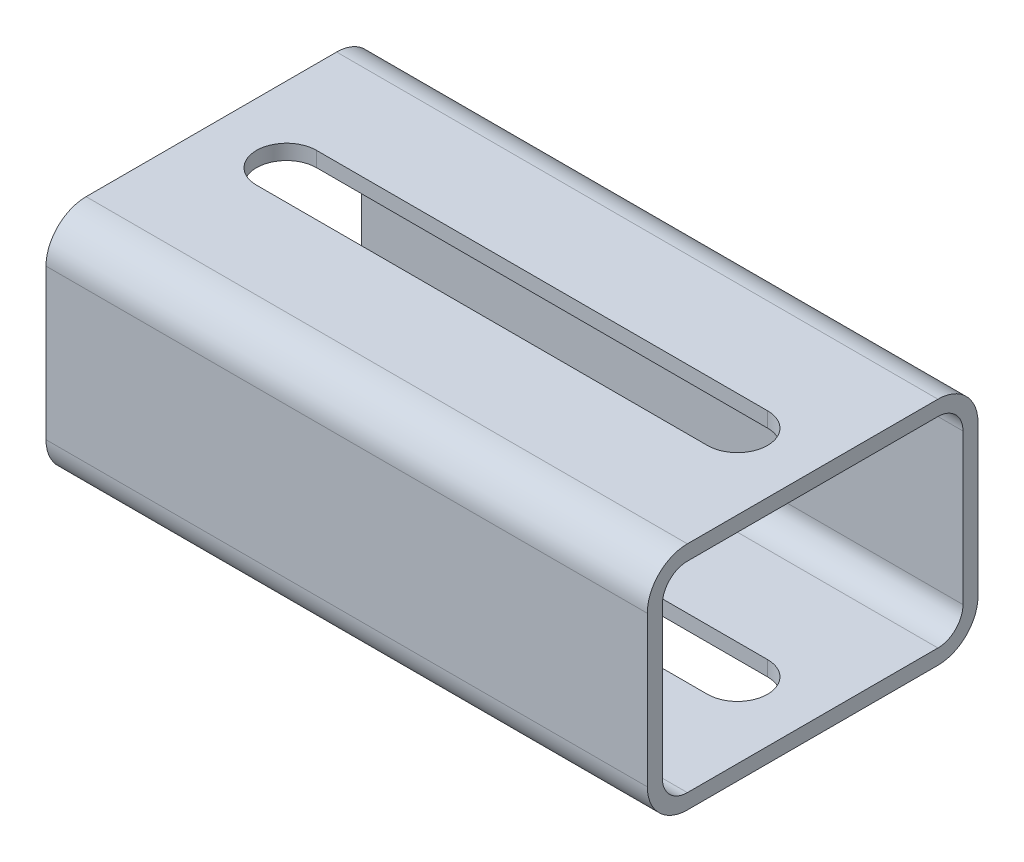
ISO-10303-21;
HEADER;
FILE_DESCRIPTION(('STEP AP214'),'2;1');
FILE_NAME('part.step','',(''),(''),'','','');
FILE_SCHEMA(('AUTOMOTIVE_DESIGN { 1 0 10303 214 1 1 1 1 }'));
ENDSEC;
DATA;
#1=APPLICATION_CONTEXT('core data for automotive mechanical design processes');
#2=APPLICATION_PROTOCOL_DEFINITION('international standard','automotive_design',2000,#1);
#3=PRODUCT_CONTEXT('',#1,'mechanical');
#4=PRODUCT('Part','Part','',(#3));
#5=PRODUCT_RELATED_PRODUCT_CATEGORY('part','',(#4));
#6=PRODUCT_DEFINITION_FORMATION('','',#4);
#7=PRODUCT_DEFINITION_CONTEXT('part definition',#1,'design');
#8=PRODUCT_DEFINITION('design','',#6,#7);
#9=PRODUCT_DEFINITION_SHAPE('','',#8);
#10=(LENGTH_UNIT() NAMED_UNIT(*) SI_UNIT(.MILLI.,.METRE.));
#11=(NAMED_UNIT(*) PLANE_ANGLE_UNIT() SI_UNIT($,.RADIAN.));
#12=(NAMED_UNIT(*) SI_UNIT($,.STERADIAN.) SOLID_ANGLE_UNIT());
#13=UNCERTAINTY_MEASURE_WITH_UNIT(LENGTH_MEASURE(1.E-05),#10,'distance_accuracy_value','');
#14=(GEOMETRIC_REPRESENTATION_CONTEXT(3) GLOBAL_UNCERTAINTY_ASSIGNED_CONTEXT((#13)) GLOBAL_UNIT_ASSIGNED_CONTEXT((#10,
#11,#12)) REPRESENTATION_CONTEXT('',''));
#15=CARTESIAN_POINT('',(0.,0.,0.));
#16=DIRECTION('',(0.,0.,1.));
#17=DIRECTION('',(1.,0.,0.));
#18=AXIS2_PLACEMENT_3D('',#15,#16,#17);
#19=CARTESIAN_POINT('',(60.,15.,-25.));
#20=DIRECTION('',(-1.,0.,0.));
#21=DIRECTION('',(0.,0.,1.));
#22=AXIS2_PLACEMENT_3D('',#19,#20,#21);
#23=PLANE('',#22);
#24=CARTESIAN_POINT('',(60.,15.,-25.));
#25=DIRECTION('',(-1.,0.,0.));
#26=DIRECTION('',(0.,0.,1.));
#27=AXIS2_PLACEMENT_3D('',#24,#25,#26);
#28=CIRCLE('',#27,8.);
#29=CARTESIAN_POINT('',(60.,15.,-33.));
#30=VERTEX_POINT('',#29);
#31=CARTESIAN_POINT('',(60.,23.,-25.));
#32=VERTEX_POINT('',#31);
#33=EDGE_CURVE('E404',#30,#32,#28,.F.);
#34=ORIENTED_EDGE('',*,*,#33,.T.);
#35=DIRECTION('',(0.,0.,1.));
#36=VECTOR('',#35,1.);
#37=CARTESIAN_POINT('',(60.,23.,-25.));
#38=LINE('',#37,#36);
#39=CARTESIAN_POINT('',(60.,23.,25.));
#40=VERTEX_POINT('',#39);
#41=EDGE_CURVE('E408',#32,#40,#38,.T.);
#42=ORIENTED_EDGE('',*,*,#41,.T.);
#43=CARTESIAN_POINT('',(60.,15.,25.));
#44=DIRECTION('',(-1.,0.,0.));
#45=DIRECTION('',(0.,0.,1.));
#46=AXIS2_PLACEMENT_3D('',#43,#44,#45);
#47=CIRCLE('',#46,8.);
#48=CARTESIAN_POINT('',(60.,15.,33.));
#49=VERTEX_POINT('',#48);
#50=EDGE_CURVE('E412',#40,#49,#47,.F.);
#51=ORIENTED_EDGE('',*,*,#50,.T.);
#52=DIRECTION('',(0.,-1.,0.));
#53=VECTOR('',#52,1.);
#54=CARTESIAN_POINT('',(60.,15.,33.));
#55=LINE('',#54,#53);
#56=CARTESIAN_POINT('',(60.,-15.,33.));
#57=VERTEX_POINT('',#56);
#58=EDGE_CURVE('E415',#49,#57,#55,.T.);
#59=ORIENTED_EDGE('',*,*,#58,.T.);
#60=CARTESIAN_POINT('',(60.,-15.,25.));
#61=DIRECTION('',(-1.,0.,0.));
#62=DIRECTION('',(0.,0.,1.));
#63=AXIS2_PLACEMENT_3D('',#60,#61,#62);
#64=CIRCLE('',#63,8.);
#65=CARTESIAN_POINT('',(60.,-23.,25.));
#66=VERTEX_POINT('',#65);
#67=EDGE_CURVE('E418',#57,#66,#64,.F.);
#68=ORIENTED_EDGE('',*,*,#67,.T.);
#69=DIRECTION('',(0.,0.,-1.));
#70=VECTOR('',#69,1.);
#71=CARTESIAN_POINT('',(60.,-23.,-25.));
#72=LINE('',#71,#70);
#73=CARTESIAN_POINT('',(60.,-23.,-25.));
#74=VERTEX_POINT('',#73);
#75=EDGE_CURVE('E421',#66,#74,#72,.T.);
#76=ORIENTED_EDGE('',*,*,#75,.T.);
#77=CARTESIAN_POINT('',(60.,-15.,-25.));
#78=DIRECTION('',(-1.,0.,0.));
#79=DIRECTION('',(0.,0.,1.));
#80=AXIS2_PLACEMENT_3D('',#77,#78,#79);
#81=CIRCLE('',#80,8.);
#82=CARTESIAN_POINT('',(60.,-15.,-33.));
#83=VERTEX_POINT('',#82);
#84=EDGE_CURVE('E424',#74,#83,#81,.F.);
#85=ORIENTED_EDGE('',*,*,#84,.T.);
#86=DIRECTION('',(0.,1.,0.));
#87=VECTOR('',#86,1.);
#88=CARTESIAN_POINT('',(60.,15.,-33.));
#89=LINE('',#88,#87);
#90=EDGE_CURVE('E427',#83,#30,#89,.T.);
#91=ORIENTED_EDGE('',*,*,#90,.T.);
#92=EDGE_LOOP('',(#34,#42,#51,#59,#68,#76,#85,#91));
#93=FACE_BOUND('',#92,.T.);
#94=CARTESIAN_POINT('',(60.,15.,-25.));
#95=DIRECTION('',(1.,0.,0.));
#96=DIRECTION('',(0.,0.,1.));
#97=AXIS2_PLACEMENT_3D('',#94,#95,#96);
#98=CIRCLE('',#97,5.);
#99=CARTESIAN_POINT('',(60.,15.,-30.));
#100=VERTEX_POINT('',#99);
#101=CARTESIAN_POINT('',(60.,20.,-25.));
#102=VERTEX_POINT('',#101);
#103=EDGE_CURVE('E321',#100,#102,#98,.T.);
#104=ORIENTED_EDGE('',*,*,#103,.F.);
#105=DIRECTION('',(0.,1.,0.));
#106=VECTOR('',#105,1.);
#107=CARTESIAN_POINT('',(60.,-15.,-30.));
#108=LINE('',#107,#106);
#109=CARTESIAN_POINT('',(60.,-15.,-30.));
#110=VERTEX_POINT('',#109);
#111=EDGE_CURVE('E344',#110,#100,#108,.T.);
#112=ORIENTED_EDGE('',*,*,#111,.F.);
#113=CARTESIAN_POINT('',(60.,-15.,-25.));
#114=DIRECTION('',(1.,0.,0.));
#115=DIRECTION('',(0.,0.,-1.));
#116=AXIS2_PLACEMENT_3D('',#113,#114,#115);
#117=CIRCLE('',#116,5.);
#118=CARTESIAN_POINT('',(60.,-20.,-25.));
#119=VERTEX_POINT('',#118);
#120=EDGE_CURVE('E340',#119,#110,#117,.T.);
#121=ORIENTED_EDGE('',*,*,#120,.F.);
#122=DIRECTION('',(0.,0.,-1.));
#123=VECTOR('',#122,1.);
#124=CARTESIAN_POINT('',(60.,-20.,25.));
#125=LINE('',#124,#123);
#126=CARTESIAN_POINT('',(60.,-20.,25.));
#127=VERTEX_POINT('',#126);
#128=EDGE_CURVE('E337',#127,#119,#125,.T.);
#129=ORIENTED_EDGE('',*,*,#128,.F.);
#130=CARTESIAN_POINT('',(60.,-15.,25.));
#131=DIRECTION('',(1.,0.,0.));
#132=DIRECTION('',(0.,0.,1.));
#133=AXIS2_PLACEMENT_3D('',#130,#131,#132);
#134=CIRCLE('',#133,5.);
#135=CARTESIAN_POINT('',(60.,-15.,30.));
#136=VERTEX_POINT('',#135);
#137=EDGE_CURVE('E334',#136,#127,#134,.T.);
#138=ORIENTED_EDGE('',*,*,#137,.F.);
#139=DIRECTION('',(0.,-1.,0.));
#140=VECTOR('',#139,1.);
#141=CARTESIAN_POINT('',(60.,-15.,30.));
#142=LINE('',#141,#140);
#143=CARTESIAN_POINT('',(60.,15.,30.));
#144=VERTEX_POINT('',#143);
#145=EDGE_CURVE('E331',#144,#136,#142,.T.);
#146=ORIENTED_EDGE('',*,*,#145,.F.);
#147=CARTESIAN_POINT('',(60.,15.,25.));
#148=DIRECTION('',(1.,0.,0.));
#149=DIRECTION('',(0.,0.,-1.));
#150=AXIS2_PLACEMENT_3D('',#147,#148,#149);
#151=CIRCLE('',#150,5.);
#152=CARTESIAN_POINT('',(60.,20.,25.));
#153=VERTEX_POINT('',#152);
#154=EDGE_CURVE('E328',#153,#144,#151,.T.);
#155=ORIENTED_EDGE('',*,*,#154,.F.);
#156=DIRECTION('',(0.,0.,1.));
#157=VECTOR('',#156,1.);
#158=CARTESIAN_POINT('',(60.,20.,25.));
#159=LINE('',#158,#157);
#160=EDGE_CURVE('E324',#102,#153,#159,.T.);
#161=ORIENTED_EDGE('',*,*,#160,.F.);
#162=EDGE_LOOP('',(#104,#112,#121,#129,#138,#146,#155,#161));
#163=FACE_BOUND('',#162,.T.);
#164=ADVANCED_FACE('F87',(#93,#163),#23,.F.);
#165=CARTESIAN_POINT('',(-60.,15.,-25.));
#166=DIRECTION('',(-1.,0.,0.));
#167=DIRECTION('',(0.,0.,1.));
#168=AXIS2_PLACEMENT_3D('',#165,#166,#167);
#169=PLANE('',#168);
#170=CARTESIAN_POINT('',(-60.,15.,-25.));
#171=DIRECTION('',(-1.,0.,0.));
#172=DIRECTION('',(0.,0.,1.));
#173=AXIS2_PLACEMENT_3D('',#170,#171,#172);
#174=CIRCLE('',#173,8.);
#175=CARTESIAN_POINT('',(-60.,15.,-33.));
#176=VERTEX_POINT('',#175);
#177=CARTESIAN_POINT('',(-60.,23.,-25.));
#178=VERTEX_POINT('',#177);
#179=EDGE_CURVE('E403',#176,#178,#174,.F.);
#180=ORIENTED_EDGE('',*,*,#179,.F.);
#181=DIRECTION('',(0.,1.,0.));
#182=VECTOR('',#181,1.);
#183=CARTESIAN_POINT('',(-60.,15.,-33.));
#184=LINE('',#183,#182);
#185=CARTESIAN_POINT('',(-60.,-15.,-33.));
#186=VERTEX_POINT('',#185);
#187=EDGE_CURVE('E409',#186,#176,#184,.T.);
#188=ORIENTED_EDGE('',*,*,#187,.F.);
#189=CARTESIAN_POINT('',(-60.,-15.,-25.));
#190=DIRECTION('',(-1.,0.,0.));
#191=DIRECTION('',(0.,0.,1.));
#192=AXIS2_PLACEMENT_3D('',#189,#190,#191);
#193=CIRCLE('',#192,8.);
#194=CARTESIAN_POINT('',(-60.,-23.,-25.));
#195=VERTEX_POINT('',#194);
#196=EDGE_CURVE('E449',#195,#186,#193,.F.);
#197=ORIENTED_EDGE('',*,*,#196,.F.);
#198=DIRECTION('',(0.,0.,-1.));
#199=VECTOR('',#198,1.);
#200=CARTESIAN_POINT('',(-60.,-23.,-25.));
#201=LINE('',#200,#199);
#202=CARTESIAN_POINT('',(-60.,-23.,25.));
#203=VERTEX_POINT('',#202);
#204=EDGE_CURVE('E446',#203,#195,#201,.T.);
#205=ORIENTED_EDGE('',*,*,#204,.F.);
#206=CARTESIAN_POINT('',(-60.,-15.,25.));
#207=DIRECTION('',(-1.,0.,0.));
#208=DIRECTION('',(0.,0.,1.));
#209=AXIS2_PLACEMENT_3D('',#206,#207,#208);
#210=CIRCLE('',#209,8.);
#211=CARTESIAN_POINT('',(-60.,-15.,33.));
#212=VERTEX_POINT('',#211);
#213=EDGE_CURVE('E443',#212,#203,#210,.F.);
#214=ORIENTED_EDGE('',*,*,#213,.F.);
#215=DIRECTION('',(0.,-1.,0.));
#216=VECTOR('',#215,1.);
#217=CARTESIAN_POINT('',(-60.,15.,33.));
#218=LINE('',#217,#216);
#219=CARTESIAN_POINT('',(-60.,15.,33.));
#220=VERTEX_POINT('',#219);
#221=EDGE_CURVE('E440',#220,#212,#218,.T.);
#222=ORIENTED_EDGE('',*,*,#221,.F.);
#223=CARTESIAN_POINT('',(-60.,15.,25.));
#224=DIRECTION('',(-1.,0.,0.));
#225=DIRECTION('',(0.,0.,1.));
#226=AXIS2_PLACEMENT_3D('',#223,#224,#225);
#227=CIRCLE('',#226,8.);
#228=CARTESIAN_POINT('',(-60.,23.,25.));
#229=VERTEX_POINT('',#228);
#230=EDGE_CURVE('E437',#229,#220,#227,.F.);
#231=ORIENTED_EDGE('',*,*,#230,.F.);
#232=DIRECTION('',(0.,0.,1.));
#233=VECTOR('',#232,1.);
#234=CARTESIAN_POINT('',(-60.,23.,-25.));
#235=LINE('',#234,#233);
#236=EDGE_CURVE('E434',#178,#229,#235,.T.);
#237=ORIENTED_EDGE('',*,*,#236,.F.);
#238=EDGE_LOOP('',(#180,#188,#197,#205,#214,#222,#231,#237));
#239=FACE_BOUND('',#238,.T.);
#240=DIRECTION('',(0.,1.,0.));
#241=VECTOR('',#240,1.);
#242=CARTESIAN_POINT('',(-60.,-15.,-30.));
#243=LINE('',#242,#241);
#244=CARTESIAN_POINT('',(-60.,-15.,-30.));
#245=VERTEX_POINT('',#244);
#246=CARTESIAN_POINT('',(-60.,15.,-30.));
#247=VERTEX_POINT('',#246);
#248=EDGE_CURVE('E325',#245,#247,#243,.T.);
#249=ORIENTED_EDGE('',*,*,#248,.T.);
#250=CARTESIAN_POINT('',(-60.,15.,-25.));
#251=DIRECTION('',(1.,0.,0.));
#252=DIRECTION('',(0.,0.,1.));
#253=AXIS2_PLACEMENT_3D('',#250,#251,#252);
#254=CIRCLE('',#253,5.);
#255=CARTESIAN_POINT('',(-60.,20.,-25.));
#256=VERTEX_POINT('',#255);
#257=EDGE_CURVE('E320',#247,#256,#254,.T.);
#258=ORIENTED_EDGE('',*,*,#257,.T.);
#259=DIRECTION('',(0.,0.,1.));
#260=VECTOR('',#259,1.);
#261=CARTESIAN_POINT('',(-60.,20.,25.));
#262=LINE('',#261,#260);
#263=CARTESIAN_POINT('',(-60.,20.,25.));
#264=VERTEX_POINT('',#263);
#265=EDGE_CURVE('E351',#256,#264,#262,.T.);
#266=ORIENTED_EDGE('',*,*,#265,.T.);
#267=CARTESIAN_POINT('',(-60.,15.,25.));
#268=DIRECTION('',(1.,0.,0.));
#269=DIRECTION('',(0.,0.,-1.));
#270=AXIS2_PLACEMENT_3D('',#267,#268,#269);
#271=CIRCLE('',#270,5.);
#272=CARTESIAN_POINT('',(-60.,15.,30.));
#273=VERTEX_POINT('',#272);
#274=EDGE_CURVE('E355',#264,#273,#271,.T.);
#275=ORIENTED_EDGE('',*,*,#274,.T.);
#276=DIRECTION('',(0.,-1.,0.));
#277=VECTOR('',#276,1.);
#278=CARTESIAN_POINT('',(-60.,-15.,30.));
#279=LINE('',#278,#277);
#280=CARTESIAN_POINT('',(-60.,-15.,30.));
#281=VERTEX_POINT('',#280);
#282=EDGE_CURVE('E359',#273,#281,#279,.T.);
#283=ORIENTED_EDGE('',*,*,#282,.T.);
#284=CARTESIAN_POINT('',(-60.,-15.,25.));
#285=DIRECTION('',(1.,0.,0.));
#286=DIRECTION('',(0.,0.,1.));
#287=AXIS2_PLACEMENT_3D('',#284,#285,#286);
#288=CIRCLE('',#287,5.);
#289=CARTESIAN_POINT('',(-60.,-20.,25.));
#290=VERTEX_POINT('',#289);
#291=EDGE_CURVE('E363',#281,#290,#288,.T.);
#292=ORIENTED_EDGE('',*,*,#291,.T.);
#293=DIRECTION('',(0.,0.,-1.));
#294=VECTOR('',#293,1.);
#295=CARTESIAN_POINT('',(-60.,-20.,25.));
#296=LINE('',#295,#294);
#297=CARTESIAN_POINT('',(-60.,-20.,-25.));
#298=VERTEX_POINT('',#297);
#299=EDGE_CURVE('E367',#290,#298,#296,.T.);
#300=ORIENTED_EDGE('',*,*,#299,.T.);
#301=CARTESIAN_POINT('',(-60.,-15.,-25.));
#302=DIRECTION('',(1.,0.,0.));
#303=DIRECTION('',(0.,0.,-1.));
#304=AXIS2_PLACEMENT_3D('',#301,#302,#303);
#305=CIRCLE('',#304,5.);
#306=EDGE_CURVE('E371',#298,#245,#305,.T.);
#307=ORIENTED_EDGE('',*,*,#306,.T.);
#308=EDGE_LOOP('',(#249,#258,#266,#275,#283,#292,#300,#307));
#309=FACE_BOUND('',#308,.T.);
#310=ADVANCED_FACE('F514',(#239,#309),#169,.T.);
#311=CARTESIAN_POINT('',(60.,15.,-25.));
#312=DIRECTION('',(-1.,0.,0.));
#313=DIRECTION('',(0.,0.,1.));
#314=AXIS2_PLACEMENT_3D('',#311,#312,#313);
#315=CYLINDRICAL_SURFACE('',#314,8.);
#316=ORIENTED_EDGE('',*,*,#179,.T.);
#317=DIRECTION('',(-1.,0.,0.));
#318=VECTOR('',#317,1.);
#319=CARTESIAN_POINT('',(60.,23.,-25.));
#320=LINE('',#319,#318);
#321=EDGE_CURVE('E481',#32,#178,#320,.T.);
#322=ORIENTED_EDGE('',*,*,#321,.F.);
#323=ORIENTED_EDGE('',*,*,#33,.F.);
#324=DIRECTION('',(-1.,0.,0.));
#325=VECTOR('',#324,1.);
#326=CARTESIAN_POINT('',(60.,15.,-33.));
#327=LINE('',#326,#325);
#328=EDGE_CURVE('E430',#30,#176,#327,.T.);
#329=ORIENTED_EDGE('',*,*,#328,.T.);
#330=EDGE_LOOP('',(#316,#322,#323,#329));
#331=FACE_BOUND('',#330,.T.);
#332=ADVANCED_FACE('F89',(#331),#315,.T.);
#333=CARTESIAN_POINT('',(60.,23.,-25.));
#334=DIRECTION('',(0.,-1.,0.));
#335=DIRECTION('',(0.,0.,-1.));
#336=AXIS2_PLACEMENT_3D('',#333,#334,#335);
#337=PLANE('',#336);
#338=DIRECTION('',(1.,0.,0.));
#339=VECTOR('',#338,1.);
#340=CARTESIAN_POINT('',(-45.,23.,6.00000000000001));
#341=LINE('',#340,#339);
#342=CARTESIAN_POINT('',(-45.,23.,6.00000000000001));
#343=VERTEX_POINT('',#342);
#344=CARTESIAN_POINT('',(45.,23.,5.99999999999999));
#345=VERTEX_POINT('',#344);
#346=EDGE_CURVE('E289',#343,#345,#341,.T.);
#347=ORIENTED_EDGE('',*,*,#346,.F.);
#348=CARTESIAN_POINT('',(-45.,23.,0.));
#349=DIRECTION('',(0.,1.,0.));
#350=DIRECTION('',(0.,0.,1.));
#351=AXIS2_PLACEMENT_3D('',#348,#349,#350);
#352=CIRCLE('',#351,6.00000000000001);
#353=CARTESIAN_POINT('',(-45.,23.,-6.00000000000001));
#354=VERTEX_POINT('',#353);
#355=EDGE_CURVE('E103',#354,#343,#352,.T.);
#356=ORIENTED_EDGE('',*,*,#355,.F.);
#357=DIRECTION('',(-1.,0.,0.));
#358=VECTOR('',#357,1.);
#359=CARTESIAN_POINT('',(-45.,23.,-6.00000000000001));
#360=LINE('',#359,#358);
#361=CARTESIAN_POINT('',(45.,23.,-6.00000000000001));
#362=VERTEX_POINT('',#361);
#363=EDGE_CURVE('E276',#362,#354,#360,.T.);
#364=ORIENTED_EDGE('',*,*,#363,.F.);
#365=CARTESIAN_POINT('',(45.,23.,0.));
#366=DIRECTION('',(0.,1.,0.));
#367=DIRECTION('',(0.,0.,1.));
#368=AXIS2_PLACEMENT_3D('',#365,#366,#367);
#369=CIRCLE('',#368,6.00000000000001);
#370=EDGE_CURVE('E280',#345,#362,#369,.T.);
#371=ORIENTED_EDGE('',*,*,#370,.F.);
#372=EDGE_LOOP('',(#347,#356,#364,#371));
#373=FACE_BOUND('',#372,.T.);
#374=ORIENTED_EDGE('',*,*,#236,.T.);
#375=DIRECTION('',(-1.,0.,0.));
#376=VECTOR('',#375,1.);
#377=CARTESIAN_POINT('',(60.,23.,25.));
#378=LINE('',#377,#376);
#379=EDGE_CURVE('E477',#40,#229,#378,.T.);
#380=ORIENTED_EDGE('',*,*,#379,.F.);
#381=ORIENTED_EDGE('',*,*,#41,.F.);
#382=ORIENTED_EDGE('',*,*,#321,.T.);
#383=EDGE_LOOP('',(#374,#380,#381,#382));
#384=FACE_BOUND('',#383,.T.);
#385=ADVANCED_FACE('F547',(#373,#384),#337,.F.);
#386=CARTESIAN_POINT('',(60.,15.,25.));
#387=DIRECTION('',(-1.,0.,0.));
#388=DIRECTION('',(0.,0.,1.));
#389=AXIS2_PLACEMENT_3D('',#386,#387,#388);
#390=CYLINDRICAL_SURFACE('',#389,8.);
#391=ORIENTED_EDGE('',*,*,#230,.T.);
#392=DIRECTION('',(-1.,0.,0.));
#393=VECTOR('',#392,1.);
#394=CARTESIAN_POINT('',(60.,15.,33.));
#395=LINE('',#394,#393);
#396=EDGE_CURVE('E473',#49,#220,#395,.T.);
#397=ORIENTED_EDGE('',*,*,#396,.F.);
#398=ORIENTED_EDGE('',*,*,#50,.F.);
#399=ORIENTED_EDGE('',*,*,#379,.T.);
#400=EDGE_LOOP('',(#391,#397,#398,#399));
#401=FACE_BOUND('',#400,.T.);
#402=ADVANCED_FACE('F544',(#401),#390,.T.);
#403=CARTESIAN_POINT('',(60.,15.,33.));
#404=DIRECTION('',(0.,0.,-1.));
#405=DIRECTION('',(-1.,0.,0.));
#406=AXIS2_PLACEMENT_3D('',#403,#404,#405);
#407=PLANE('',#406);
#408=ORIENTED_EDGE('',*,*,#221,.T.);
#409=DIRECTION('',(-1.,0.,0.));
#410=VECTOR('',#409,1.);
#411=CARTESIAN_POINT('',(60.,-15.,33.));
#412=LINE('',#411,#410);
#413=EDGE_CURVE('E469',#57,#212,#412,.T.);
#414=ORIENTED_EDGE('',*,*,#413,.F.);
#415=ORIENTED_EDGE('',*,*,#58,.F.);
#416=ORIENTED_EDGE('',*,*,#396,.T.);
#417=EDGE_LOOP('',(#408,#414,#415,#416));
#418=FACE_BOUND('',#417,.T.);
#419=ADVANCED_FACE('F540',(#418),#407,.F.);
#420=CARTESIAN_POINT('',(60.,-15.,25.));
#421=DIRECTION('',(-1.,0.,0.));
#422=DIRECTION('',(0.,0.,1.));
#423=AXIS2_PLACEMENT_3D('',#420,#421,#422);
#424=CYLINDRICAL_SURFACE('',#423,8.);
#425=ORIENTED_EDGE('',*,*,#213,.T.);
#426=DIRECTION('',(-1.,0.,0.));
#427=VECTOR('',#426,1.);
#428=CARTESIAN_POINT('',(60.,-23.,25.));
#429=LINE('',#428,#427);
#430=EDGE_CURVE('E465',#66,#203,#429,.T.);
#431=ORIENTED_EDGE('',*,*,#430,.F.);
#432=ORIENTED_EDGE('',*,*,#67,.F.);
#433=ORIENTED_EDGE('',*,*,#413,.T.);
#434=EDGE_LOOP('',(#425,#431,#432,#433));
#435=FACE_BOUND('',#434,.T.);
#436=ADVANCED_FACE('F537',(#435),#424,.T.);
#437=CARTESIAN_POINT('',(60.,-23.,-25.));
#438=DIRECTION('',(0.,1.,0.));
#439=DIRECTION('',(0.,0.,1.));
#440=AXIS2_PLACEMENT_3D('',#437,#438,#439);
#441=PLANE('',#440);
#442=DIRECTION('',(-1.,0.,0.));
#443=VECTOR('',#442,1.);
#444=CARTESIAN_POINT('',(-45.,-23.,-6.00000000000001));
#445=LINE('',#444,#443);
#446=CARTESIAN_POINT('',(45.,-23.,-6.00000000000001));
#447=VERTEX_POINT('',#446);
#448=CARTESIAN_POINT('',(-45.,-23.,-6.00000000000001));
#449=VERTEX_POINT('',#448);
#450=EDGE_CURVE('E274',#447,#449,#445,.T.);
#451=ORIENTED_EDGE('',*,*,#450,.T.);
#452=CARTESIAN_POINT('',(-45.,-23.,0.));
#453=DIRECTION('',(0.,1.,0.));
#454=DIRECTION('',(0.,0.,1.));
#455=AXIS2_PLACEMENT_3D('',#452,#453,#454);
#456=CIRCLE('',#455,6.00000000000001);
#457=CARTESIAN_POINT('',(-45.,-23.,6.00000000000001));
#458=VERTEX_POINT('',#457);
#459=EDGE_CURVE('E255',#449,#458,#456,.T.);
#460=ORIENTED_EDGE('',*,*,#459,.T.);
#461=DIRECTION('',(1.,0.,0.));
#462=VECTOR('',#461,1.);
#463=CARTESIAN_POINT('',(-45.,-23.,6.00000000000001));
#464=LINE('',#463,#462);
#465=CARTESIAN_POINT('',(45.,-23.,6.00000000000001));
#466=VERTEX_POINT('',#465);
#467=EDGE_CURVE('E265',#458,#466,#464,.T.);
#468=ORIENTED_EDGE('',*,*,#467,.T.);
#469=CARTESIAN_POINT('',(45.,-23.,0.));
#470=DIRECTION('',(0.,1.,0.));
#471=DIRECTION('',(0.,0.,1.));
#472=AXIS2_PLACEMENT_3D('',#469,#470,#471);
#473=CIRCLE('',#472,6.00000000000001);
#474=EDGE_CURVE('E111',#466,#447,#473,.T.);
#475=ORIENTED_EDGE('',*,*,#474,.T.);
#476=EDGE_LOOP('',(#451,#460,#468,#475));
#477=FACE_BOUND('',#476,.T.);
#478=ORIENTED_EDGE('',*,*,#204,.T.);
#479=DIRECTION('',(-1.,0.,0.));
#480=VECTOR('',#479,1.);
#481=CARTESIAN_POINT('',(60.,-23.,-25.));
#482=LINE('',#481,#480);
#483=EDGE_CURVE('E461',#74,#195,#482,.T.);
#484=ORIENTED_EDGE('',*,*,#483,.F.);
#485=ORIENTED_EDGE('',*,*,#75,.F.);
#486=ORIENTED_EDGE('',*,*,#430,.T.);
#487=EDGE_LOOP('',(#478,#484,#485,#486));
#488=FACE_BOUND('',#487,.T.);
#489=ADVANCED_FACE('F271',(#477,#488),#441,.F.);
#490=CARTESIAN_POINT('',(60.,-15.,-25.));
#491=DIRECTION('',(-1.,0.,0.));
#492=DIRECTION('',(0.,0.,1.));
#493=AXIS2_PLACEMENT_3D('',#490,#491,#492);
#494=CYLINDRICAL_SURFACE('',#493,8.);
#495=ORIENTED_EDGE('',*,*,#196,.T.);
#496=DIRECTION('',(-1.,0.,0.));
#497=VECTOR('',#496,1.);
#498=CARTESIAN_POINT('',(60.,-15.,-33.));
#499=LINE('',#498,#497);
#500=EDGE_CURVE('E457',#83,#186,#499,.T.);
#501=ORIENTED_EDGE('',*,*,#500,.F.);
#502=ORIENTED_EDGE('',*,*,#84,.F.);
#503=ORIENTED_EDGE('',*,*,#483,.T.);
#504=EDGE_LOOP('',(#495,#501,#502,#503));
#505=FACE_BOUND('',#504,.T.);
#506=ADVANCED_FACE('F530',(#505),#494,.T.);
#507=CARTESIAN_POINT('',(60.,15.,-33.));
#508=DIRECTION('',(0.,0.,1.));
#509=DIRECTION('',(1.,0.,0.));
#510=AXIS2_PLACEMENT_3D('',#507,#508,#509);
#511=PLANE('',#510);
#512=ORIENTED_EDGE('',*,*,#187,.T.);
#513=ORIENTED_EDGE('',*,*,#328,.F.);
#514=ORIENTED_EDGE('',*,*,#90,.F.);
#515=ORIENTED_EDGE('',*,*,#500,.T.);
#516=EDGE_LOOP('',(#512,#513,#514,#515));
#517=FACE_BOUND('',#516,.T.);
#518=ADVANCED_FACE('F527',(#517),#511,.F.);
#519=CARTESIAN_POINT('',(60.,15.,-25.));
#520=DIRECTION('',(-1.,0.,0.));
#521=DIRECTION('',(0.,0.,1.));
#522=AXIS2_PLACEMENT_3D('',#519,#520,#521);
#523=CYLINDRICAL_SURFACE('',#522,5.);
#524=ORIENTED_EDGE('',*,*,#257,.F.);
#525=DIRECTION('',(-1.,0.,0.));
#526=VECTOR('',#525,1.);
#527=CARTESIAN_POINT('',(60.,15.,-30.));
#528=LINE('',#527,#526);
#529=EDGE_CURVE('E347',#100,#247,#528,.T.);
#530=ORIENTED_EDGE('',*,*,#529,.F.);
#531=ORIENTED_EDGE('',*,*,#103,.T.);
#532=DIRECTION('',(-1.,0.,0.));
#533=VECTOR('',#532,1.);
#534=CARTESIAN_POINT('',(60.,20.,-25.));
#535=LINE('',#534,#533);
#536=EDGE_CURVE('E399',#102,#256,#535,.T.);
#537=ORIENTED_EDGE('',*,*,#536,.T.);
#538=EDGE_LOOP('',(#524,#530,#531,#537));
#539=FACE_BOUND('',#538,.T.);
#540=ADVANCED_FACE('F524',(#539),#523,.F.);
#541=CARTESIAN_POINT('',(60.,20.,25.));
#542=DIRECTION('',(0.,-1.,0.));
#543=DIRECTION('',(0.,0.,-1.));
#544=AXIS2_PLACEMENT_3D('',#541,#542,#543);
#545=PLANE('',#544);
#546=CARTESIAN_POINT('',(-45.,20.,0.));
#547=DIRECTION('',(0.,-1.,0.));
#548=DIRECTION('',(0.,0.,-1.));
#549=AXIS2_PLACEMENT_3D('',#546,#547,#548);
#550=CIRCLE('',#549,6.00000000000001);
#551=CARTESIAN_POINT('',(-45.,20.,6.00000000000001));
#552=VERTEX_POINT('',#551);
#553=CARTESIAN_POINT('',(-45.,20.,-6.00000000000001));
#554=VERTEX_POINT('',#553);
#555=EDGE_CURVE('E317',#552,#554,#550,.T.);
#556=ORIENTED_EDGE('',*,*,#555,.F.);
#557=DIRECTION('',(-1.,0.,0.));
#558=VECTOR('',#557,1.);
#559=CARTESIAN_POINT('',(60.,20.,6.00000000000001));
#560=LINE('',#559,#558);
#561=CARTESIAN_POINT('',(45.,20.,6.00000000000001));
#562=VERTEX_POINT('',#561);
#563=EDGE_CURVE('E299',#562,#552,#560,.T.);
#564=ORIENTED_EDGE('',*,*,#563,.F.);
#565=CARTESIAN_POINT('',(45.,20.,0.));
#566=DIRECTION('',(0.,-1.,0.));
#567=DIRECTION('',(0.,0.,-1.));
#568=AXIS2_PLACEMENT_3D('',#565,#566,#567);
#569=CIRCLE('',#568,6.00000000000001);
#570=CARTESIAN_POINT('',(45.,20.,-6.00000000000001));
#571=VERTEX_POINT('',#570);
#572=EDGE_CURVE('E310',#571,#562,#569,.T.);
#573=ORIENTED_EDGE('',*,*,#572,.F.);
#574=DIRECTION('',(1.,0.,0.));
#575=VECTOR('',#574,1.);
#576=CARTESIAN_POINT('',(60.,20.,-6.00000000000001));
#577=LINE('',#576,#575);
#578=EDGE_CURVE('E314',#554,#571,#577,.T.);
#579=ORIENTED_EDGE('',*,*,#578,.F.);
#580=EDGE_LOOP('',(#556,#564,#573,#579));
#581=FACE_BOUND('',#580,.T.);
#582=ORIENTED_EDGE('',*,*,#265,.F.);
#583=ORIENTED_EDGE('',*,*,#536,.F.);
#584=ORIENTED_EDGE('',*,*,#160,.T.);
#585=DIRECTION('',(-1.,0.,0.));
#586=VECTOR('',#585,1.);
#587=CARTESIAN_POINT('',(60.,20.,25.));
#588=LINE('',#587,#586);
#589=EDGE_CURVE('E396',#153,#264,#588,.T.);
#590=ORIENTED_EDGE('',*,*,#589,.T.);
#591=EDGE_LOOP('',(#582,#583,#584,#590));
#592=FACE_BOUND('',#591,.T.);
#593=ADVANCED_FACE('F595',(#581,#592),#545,.T.);
#594=CARTESIAN_POINT('',(60.,15.,25.));
#595=DIRECTION('',(-1.,0.,0.));
#596=DIRECTION('',(0.,0.,1.));
#597=AXIS2_PLACEMENT_3D('',#594,#595,#596);
#598=CYLINDRICAL_SURFACE('',#597,5.);
#599=ORIENTED_EDGE('',*,*,#274,.F.);
#600=ORIENTED_EDGE('',*,*,#589,.F.);
#601=ORIENTED_EDGE('',*,*,#154,.T.);
#602=DIRECTION('',(-1.,0.,0.));
#603=VECTOR('',#602,1.);
#604=CARTESIAN_POINT('',(60.,15.,30.));
#605=LINE('',#604,#603);
#606=EDGE_CURVE('E393',#144,#273,#605,.T.);
#607=ORIENTED_EDGE('',*,*,#606,.T.);
#608=EDGE_LOOP('',(#599,#600,#601,#607));
#609=FACE_BOUND('',#608,.T.);
#610=ADVANCED_FACE('F598',(#609),#598,.F.);
#611=CARTESIAN_POINT('',(60.,-15.,30.));
#612=DIRECTION('',(0.,0.,-1.));
#613=DIRECTION('',(-1.,0.,0.));
#614=AXIS2_PLACEMENT_3D('',#611,#612,#613);
#615=PLANE('',#614);
#616=ORIENTED_EDGE('',*,*,#282,.F.);
#617=ORIENTED_EDGE('',*,*,#606,.F.);
#618=ORIENTED_EDGE('',*,*,#145,.T.);
#619=DIRECTION('',(-1.,0.,0.));
#620=VECTOR('',#619,1.);
#621=CARTESIAN_POINT('',(60.,-15.,30.));
#622=LINE('',#621,#620);
#623=EDGE_CURVE('E390',#136,#281,#622,.T.);
#624=ORIENTED_EDGE('',*,*,#623,.T.);
#625=EDGE_LOOP('',(#616,#617,#618,#624));
#626=FACE_BOUND('',#625,.T.);
#627=ADVANCED_FACE('F603',(#626),#615,.T.);
#628=CARTESIAN_POINT('',(60.,-15.,25.));
#629=DIRECTION('',(-1.,0.,0.));
#630=DIRECTION('',(0.,0.,1.));
#631=AXIS2_PLACEMENT_3D('',#628,#629,#630);
#632=CYLINDRICAL_SURFACE('',#631,5.);
#633=ORIENTED_EDGE('',*,*,#291,.F.);
#634=ORIENTED_EDGE('',*,*,#623,.F.);
#635=ORIENTED_EDGE('',*,*,#137,.T.);
#636=DIRECTION('',(-1.,0.,0.));
#637=VECTOR('',#636,1.);
#638=CARTESIAN_POINT('',(60.,-20.,25.));
#639=LINE('',#638,#637);
#640=EDGE_CURVE('E387',#127,#290,#639,.T.);
#641=ORIENTED_EDGE('',*,*,#640,.T.);
#642=EDGE_LOOP('',(#633,#634,#635,#641));
#643=FACE_BOUND('',#642,.T.);
#644=ADVANCED_FACE('F607',(#643),#632,.F.);
#645=CARTESIAN_POINT('',(60.,-20.,25.));
#646=DIRECTION('',(0.,1.,0.));
#647=DIRECTION('',(0.,0.,1.));
#648=AXIS2_PLACEMENT_3D('',#645,#646,#647);
#649=PLANE('',#648);
#650=CARTESIAN_POINT('',(-45.,-20.,0.));
#651=DIRECTION('',(0.,1.,0.));
#652=DIRECTION('',(0.,0.,1.));
#653=AXIS2_PLACEMENT_3D('',#650,#651,#652);
#654=CIRCLE('',#653,6.00000000000001);
#655=CARTESIAN_POINT('',(-45.,-20.,-6.00000000000001));
#656=VERTEX_POINT('',#655);
#657=CARTESIAN_POINT('',(-45.,-20.,6.00000000000001));
#658=VERTEX_POINT('',#657);
#659=EDGE_CURVE('E12',#656,#658,#654,.T.);
#660=ORIENTED_EDGE('',*,*,#659,.F.);
#661=DIRECTION('',(-1.,0.,0.));
#662=VECTOR('',#661,1.);
#663=CARTESIAN_POINT('',(60.,-20.,-6.00000000000001));
#664=LINE('',#663,#662);
#665=CARTESIAN_POINT('',(45.,-20.,-6.00000000000001));
#666=VERTEX_POINT('',#665);
#667=EDGE_CURVE('E96',#666,#656,#664,.T.);
#668=ORIENTED_EDGE('',*,*,#667,.F.);
#669=CARTESIAN_POINT('',(45.,-20.,0.));
#670=DIRECTION('',(0.,1.,0.));
#671=DIRECTION('',(0.,0.,1.));
#672=AXIS2_PLACEMENT_3D('',#669,#670,#671);
#673=CIRCLE('',#672,6.00000000000001);
#674=CARTESIAN_POINT('',(45.,-20.,5.99999999999999));
#675=VERTEX_POINT('',#674);
#676=EDGE_CURVE('E488',#675,#666,#673,.T.);
#677=ORIENTED_EDGE('',*,*,#676,.F.);
#678=DIRECTION('',(1.,0.,0.));
#679=VECTOR('',#678,1.);
#680=CARTESIAN_POINT('',(60.,-20.,6.00000000000001));
#681=LINE('',#680,#679);
#682=EDGE_CURVE('E485',#658,#675,#681,.T.);
#683=ORIENTED_EDGE('',*,*,#682,.F.);
#684=EDGE_LOOP('',(#660,#668,#677,#683));
#685=FACE_BOUND('',#684,.T.);
#686=ORIENTED_EDGE('',*,*,#299,.F.);
#687=ORIENTED_EDGE('',*,*,#640,.F.);
#688=ORIENTED_EDGE('',*,*,#128,.T.);
#689=DIRECTION('',(-1.,0.,0.));
#690=VECTOR('',#689,1.);
#691=CARTESIAN_POINT('',(60.,-20.,-25.));
#692=LINE('',#691,#690);
#693=EDGE_CURVE('E384',#119,#298,#692,.T.);
#694=ORIENTED_EDGE('',*,*,#693,.T.);
#695=EDGE_LOOP('',(#686,#687,#688,#694));
#696=FACE_BOUND('',#695,.T.);
#697=ADVANCED_FACE('F496',(#685,#696),#649,.T.);
#698=CARTESIAN_POINT('',(60.,-15.,-25.));
#699=DIRECTION('',(-1.,0.,0.));
#700=DIRECTION('',(0.,0.,1.));
#701=AXIS2_PLACEMENT_3D('',#698,#699,#700);
#702=CYLINDRICAL_SURFACE('',#701,5.);
#703=ORIENTED_EDGE('',*,*,#306,.F.);
#704=ORIENTED_EDGE('',*,*,#693,.F.);
#705=ORIENTED_EDGE('',*,*,#120,.T.);
#706=DIRECTION('',(-1.,0.,0.));
#707=VECTOR('',#706,1.);
#708=CARTESIAN_POINT('',(60.,-15.,-30.));
#709=LINE('',#708,#707);
#710=EDGE_CURVE('E381',#110,#245,#709,.T.);
#711=ORIENTED_EDGE('',*,*,#710,.T.);
#712=EDGE_LOOP('',(#703,#704,#705,#711));
#713=FACE_BOUND('',#712,.T.);
#714=ADVANCED_FACE('F613',(#713),#702,.F.);
#715=CARTESIAN_POINT('',(60.,-15.,-30.));
#716=DIRECTION('',(0.,0.,1.));
#717=DIRECTION('',(1.,0.,0.));
#718=AXIS2_PLACEMENT_3D('',#715,#716,#717);
#719=PLANE('',#718);
#720=ORIENTED_EDGE('',*,*,#248,.F.);
#721=ORIENTED_EDGE('',*,*,#710,.F.);
#722=ORIENTED_EDGE('',*,*,#111,.T.);
#723=ORIENTED_EDGE('',*,*,#529,.T.);
#724=EDGE_LOOP('',(#720,#721,#722,#723));
#725=FACE_BOUND('',#724,.T.);
#726=ADVANCED_FACE('F508',(#725),#719,.T.);
#727=CARTESIAN_POINT('',(-45.,-23.,6.00000000000001));
#728=DIRECTION('',(0.,0.,1.));
#729=DIRECTION('',(1.,0.,0.));
#730=AXIS2_PLACEMENT_3D('',#727,#728,#729);
#731=PLANE('',#730);
#732=ORIENTED_EDGE('',*,*,#682,.T.);
#733=DIRECTION('',(0.,1.,0.));
#734=VECTOR('',#733,1.);
#735=CARTESIAN_POINT('',(45.,-23.,5.99999999999999));
#736=LINE('',#735,#734);
#737=EDGE_CURVE('E267',#466,#675,#736,.T.);
#738=ORIENTED_EDGE('',*,*,#737,.F.);
#739=ORIENTED_EDGE('',*,*,#467,.F.);
#740=DIRECTION('',(0.,1.,0.));
#741=VECTOR('',#740,1.);
#742=CARTESIAN_POINT('',(-45.,-23.,6.00000000000001));
#743=LINE('',#742,#741);
#744=EDGE_CURVE('E250',#458,#658,#743,.T.);
#745=ORIENTED_EDGE('',*,*,#744,.T.);
#746=EDGE_LOOP('',(#732,#738,#739,#745));
#747=FACE_BOUND('',#746,.T.);
#748=ADVANCED_FACE('F266',(#747),#731,.F.);
#749=CARTESIAN_POINT('',(45.,-23.,0.));
#750=DIRECTION('',(0.,1.,0.));
#751=DIRECTION('',(0.,0.,1.));
#752=AXIS2_PLACEMENT_3D('',#749,#750,#751);
#753=CYLINDRICAL_SURFACE('',#752,6.00000000000001);
#754=ORIENTED_EDGE('',*,*,#676,.T.);
#755=DIRECTION('',(0.,1.,0.));
#756=VECTOR('',#755,1.);
#757=CARTESIAN_POINT('',(45.,-23.,-6.00000000000001));
#758=LINE('',#757,#756);
#759=EDGE_CURVE('E301',#447,#666,#758,.T.);
#760=ORIENTED_EDGE('',*,*,#759,.F.);
#761=ORIENTED_EDGE('',*,*,#474,.F.);
#762=ORIENTED_EDGE('',*,*,#737,.T.);
#763=EDGE_LOOP('',(#754,#760,#761,#762));
#764=FACE_BOUND('',#763,.T.);
#765=ADVANCED_FACE('F498',(#764),#753,.F.);
#766=CARTESIAN_POINT('',(-45.,-23.,-6.00000000000001));
#767=DIRECTION('',(0.,0.,-1.));
#768=DIRECTION('',(-1.,0.,0.));
#769=AXIS2_PLACEMENT_3D('',#766,#767,#768);
#770=PLANE('',#769);
#771=ORIENTED_EDGE('',*,*,#667,.T.);
#772=DIRECTION('',(0.,1.,0.));
#773=VECTOR('',#772,1.);
#774=CARTESIAN_POINT('',(-45.,-23.,-6.00000000000001));
#775=LINE('',#774,#773);
#776=EDGE_CURVE('E296',#449,#656,#775,.T.);
#777=ORIENTED_EDGE('',*,*,#776,.F.);
#778=ORIENTED_EDGE('',*,*,#450,.F.);
#779=ORIENTED_EDGE('',*,*,#759,.T.);
#780=EDGE_LOOP('',(#771,#777,#778,#779));
#781=FACE_BOUND('',#780,.T.);
#782=ADVANCED_FACE('F493',(#781),#770,.F.);
#783=CARTESIAN_POINT('',(-45.,-23.,0.));
#784=DIRECTION('',(0.,1.,0.));
#785=DIRECTION('',(0.,0.,1.));
#786=AXIS2_PLACEMENT_3D('',#783,#784,#785);
#787=CYLINDRICAL_SURFACE('',#786,6.00000000000001);
#788=ORIENTED_EDGE('',*,*,#659,.T.);
#789=ORIENTED_EDGE('',*,*,#744,.F.);
#790=ORIENTED_EDGE('',*,*,#459,.F.);
#791=ORIENTED_EDGE('',*,*,#776,.T.);
#792=EDGE_LOOP('',(#788,#789,#790,#791));
#793=FACE_BOUND('',#792,.T.);
#794=ADVANCED_FACE('F252',(#793),#787,.F.);
#795=ORIENTED_EDGE('',*,*,#555,.T.);
#796=EDGE_CURVE('E300',#554,#354,#775,.T.);
#797=ORIENTED_EDGE('',*,*,#796,.T.);
#798=ORIENTED_EDGE('',*,*,#355,.T.);
#799=EDGE_CURVE('E262',#552,#343,#743,.T.);
#800=ORIENTED_EDGE('',*,*,#799,.F.);
#801=EDGE_LOOP('',(#795,#797,#798,#800));
#802=FACE_BOUND('',#801,.T.);
#803=ADVANCED_FACE('F639',(#802),#787,.F.);
#804=ORIENTED_EDGE('',*,*,#578,.T.);
#805=EDGE_CURVE('E305',#571,#362,#758,.T.);
#806=ORIENTED_EDGE('',*,*,#805,.T.);
#807=ORIENTED_EDGE('',*,*,#363,.T.);
#808=ORIENTED_EDGE('',*,*,#796,.F.);
#809=EDGE_LOOP('',(#804,#806,#807,#808));
#810=FACE_BOUND('',#809,.T.);
#811=ADVANCED_FACE('F507',(#810),#770,.F.);
#812=ORIENTED_EDGE('',*,*,#572,.T.);
#813=EDGE_CURVE('E261',#562,#345,#736,.T.);
#814=ORIENTED_EDGE('',*,*,#813,.T.);
#815=ORIENTED_EDGE('',*,*,#370,.T.);
#816=ORIENTED_EDGE('',*,*,#805,.F.);
#817=EDGE_LOOP('',(#812,#814,#815,#816));
#818=FACE_BOUND('',#817,.T.);
#819=ADVANCED_FACE('F501',(#818),#753,.F.);
#820=ORIENTED_EDGE('',*,*,#563,.T.);
#821=ORIENTED_EDGE('',*,*,#799,.T.);
#822=ORIENTED_EDGE('',*,*,#346,.T.);
#823=ORIENTED_EDGE('',*,*,#813,.F.);
#824=EDGE_LOOP('',(#820,#821,#822,#823));
#825=FACE_BOUND('',#824,.T.);
#826=ADVANCED_FACE('F510',(#825),#731,.F.);
#827=CLOSED_SHELL('',(#164,#310,#332,#385,#402,#419,#436,#489,#506,#518,#540,#593,#610,#627,
#644,#697,#714,#726,#748,#765,#782,#794,#803,#811,#819,#826));
#828=MANIFOLD_SOLID_BREP('B2',#827);
#829=ADVANCED_BREP_SHAPE_REPRESENTATION('',(#18,#828),#14);
#830=SHAPE_DEFINITION_REPRESENTATION(#9,#829);
ENDSEC;
END-ISO-10303-21;
